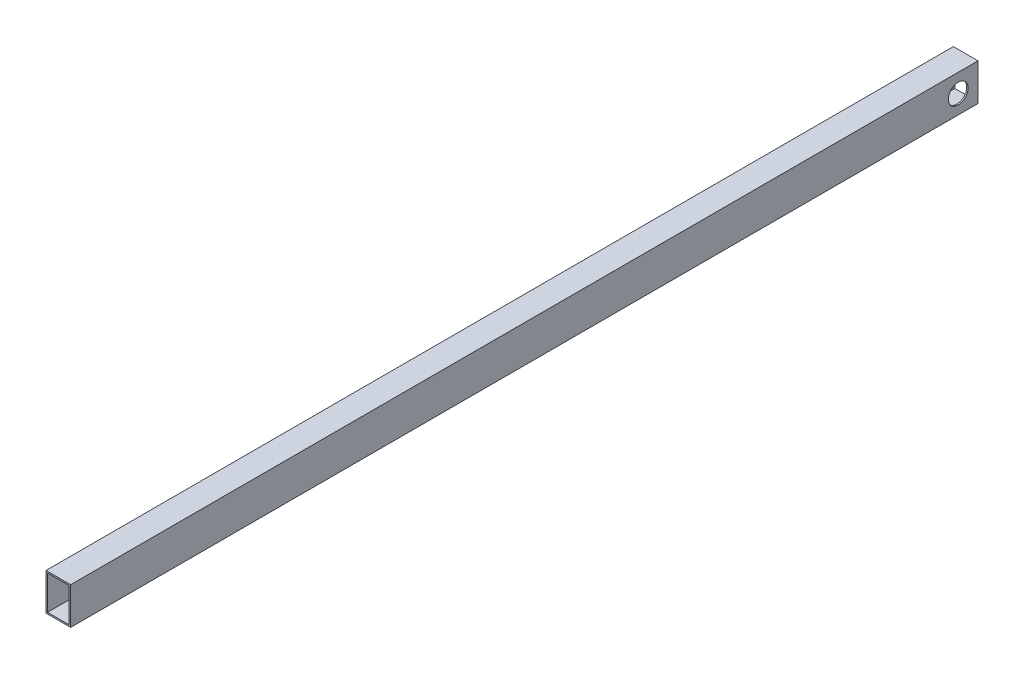
ISO-10303-21;
HEADER;
FILE_DESCRIPTION(('STEP AP214'),'2;1');
FILE_NAME('part.step','',(''),(''),'','','');
FILE_SCHEMA(('AUTOMOTIVE_DESIGN { 1 0 10303 214 1 1 1 1 }'));
ENDSEC;
DATA;
#1=APPLICATION_CONTEXT('core data for automotive mechanical design processes');
#2=APPLICATION_PROTOCOL_DEFINITION('international standard','automotive_design',2000,#1);
#3=PRODUCT_CONTEXT('',#1,'mechanical');
#4=PRODUCT('Part','Part','',(#3));
#5=PRODUCT_RELATED_PRODUCT_CATEGORY('part','',(#4));
#6=PRODUCT_DEFINITION_FORMATION('','',#4);
#7=PRODUCT_DEFINITION_CONTEXT('part definition',#1,'design');
#8=PRODUCT_DEFINITION('design','',#6,#7);
#9=PRODUCT_DEFINITION_SHAPE('','',#8);
#10=(LENGTH_UNIT() NAMED_UNIT(*) SI_UNIT(.MILLI.,.METRE.));
#11=(NAMED_UNIT(*) PLANE_ANGLE_UNIT() SI_UNIT($,.RADIAN.));
#12=(NAMED_UNIT(*) SI_UNIT($,.STERADIAN.) SOLID_ANGLE_UNIT());
#13=UNCERTAINTY_MEASURE_WITH_UNIT(LENGTH_MEASURE(1.E-05),#10,'distance_accuracy_value','');
#14=(GEOMETRIC_REPRESENTATION_CONTEXT(3) GLOBAL_UNCERTAINTY_ASSIGNED_CONTEXT((#13)) GLOBAL_UNIT_ASSIGNED_CONTEXT((#10,
#11,#12)) REPRESENTATION_CONTEXT('',''));
#15=CARTESIAN_POINT('',(0.,0.,0.));
#16=DIRECTION('',(0.,0.,1.));
#17=DIRECTION('',(1.,0.,0.));
#18=AXIS2_PLACEMENT_3D('',#15,#16,#17);
#19=CARTESIAN_POINT('',(-50.,-75.,-80.));
#20=DIRECTION('',(-1.,0.,0.));
#21=DIRECTION('',(0.,-1.,0.));
#22=AXIS2_PLACEMENT_3D('',#19,#20,#21);
#23=PLANE('',#22);
#24=CARTESIAN_POINT('',(-50.,0.,0.));
#25=DIRECTION('',(1.,0.,0.));
#26=DIRECTION('',(0.,0.,-1.));
#27=AXIS2_PLACEMENT_3D('',#24,#25,#26);
#28=CIRCLE('',#27,40.);
#29=CARTESIAN_POINT('',(-50.,0.,-40.));
#30=VERTEX_POINT('',#29);
#31=EDGE_CURVE('E195',#30,#30,#28,.T.);
#32=ORIENTED_EDGE('',*,*,#31,.T.);
#33=EDGE_LOOP('',(#32));
#34=FACE_BOUND('',#33,.T.);
#35=DIRECTION('',(0.,0.,1.));
#36=VECTOR('',#35,1.);
#37=CARTESIAN_POINT('',(-50.,-75.,-80.));
#38=LINE('',#37,#36);
#39=CARTESIAN_POINT('',(-50.,-75.,-80.));
#40=VERTEX_POINT('',#39);
#41=CARTESIAN_POINT('',(-50.,-75.,3600.));
#42=VERTEX_POINT('',#41);
#43=EDGE_CURVE('E161',#40,#42,#38,.T.);
#44=ORIENTED_EDGE('',*,*,#43,.T.);
#45=DIRECTION('',(0.,-1.,0.));
#46=VECTOR('',#45,1.);
#47=CARTESIAN_POINT('',(-50.,-75.,3600.));
#48=LINE('',#47,#46);
#49=CARTESIAN_POINT('',(-50.,74.9999999999999,3600.));
#50=VERTEX_POINT('',#49);
#51=EDGE_CURVE('E129',#50,#42,#48,.T.);
#52=ORIENTED_EDGE('',*,*,#51,.F.);
#53=DIRECTION('',(0.,0.,1.));
#54=VECTOR('',#53,1.);
#55=CARTESIAN_POINT('',(-50.,74.9999999999999,-80.));
#56=LINE('',#55,#54);
#57=CARTESIAN_POINT('',(-50.,74.9999999999999,-80.));
#58=VERTEX_POINT('',#57);
#59=EDGE_CURVE('E11',#58,#50,#56,.T.);
#60=ORIENTED_EDGE('',*,*,#59,.F.);
#61=DIRECTION('',(0.,-1.,0.));
#62=VECTOR('',#61,1.);
#63=CARTESIAN_POINT('',(-50.,-75.,-80.));
#64=LINE('',#63,#62);
#65=EDGE_CURVE('E148',#58,#40,#64,.T.);
#66=ORIENTED_EDGE('',*,*,#65,.T.);
#67=EDGE_LOOP('',(#44,#52,#60,#66));
#68=FACE_BOUND('',#67,.T.);
#69=ADVANCED_FACE('F32',(#34,#68),#23,.T.);
#70=CARTESIAN_POINT('',(-50.,74.9999999999999,-80.));
#71=DIRECTION('',(0.,1.,0.));
#72=DIRECTION('',(-1.,0.,0.));
#73=AXIS2_PLACEMENT_3D('',#70,#71,#72);
#74=PLANE('',#73);
#75=ORIENTED_EDGE('',*,*,#59,.T.);
#76=DIRECTION('',(-1.,0.,0.));
#77=VECTOR('',#76,1.);
#78=CARTESIAN_POINT('',(-50.,74.9999999999999,3600.));
#79=LINE('',#78,#77);
#80=CARTESIAN_POINT('',(50.,75.,3600.));
#81=VERTEX_POINT('',#80);
#82=EDGE_CURVE('E138',#81,#50,#79,.T.);
#83=ORIENTED_EDGE('',*,*,#82,.F.);
#84=DIRECTION('',(0.,0.,1.));
#85=VECTOR('',#84,1.);
#86=CARTESIAN_POINT('',(50.,75.,-80.));
#87=LINE('',#86,#85);
#88=CARTESIAN_POINT('',(50.,75.,-80.));
#89=VERTEX_POINT('',#88);
#90=EDGE_CURVE('E40',#89,#81,#87,.T.);
#91=ORIENTED_EDGE('',*,*,#90,.F.);
#92=DIRECTION('',(-1.,0.,0.));
#93=VECTOR('',#92,1.);
#94=CARTESIAN_POINT('',(-50.,74.9999999999999,-80.));
#95=LINE('',#94,#93);
#96=EDGE_CURVE('E159',#89,#58,#95,.T.);
#97=ORIENTED_EDGE('',*,*,#96,.T.);
#98=EDGE_LOOP('',(#75,#83,#91,#97));
#99=FACE_BOUND('',#98,.T.);
#100=ADVANCED_FACE('F173',(#99),#74,.T.);
#101=CARTESIAN_POINT('',(50.,-75.,-80.));
#102=DIRECTION('',(1.,0.,0.));
#103=DIRECTION('',(0.,1.,0.));
#104=AXIS2_PLACEMENT_3D('',#101,#102,#103);
#105=PLANE('',#104);
#106=CARTESIAN_POINT('',(50.,0.,0.));
#107=DIRECTION('',(1.,0.,0.));
#108=DIRECTION('',(0.,0.,-1.));
#109=AXIS2_PLACEMENT_3D('',#106,#107,#108);
#110=CIRCLE('',#109,40.);
#111=CARTESIAN_POINT('',(50.,0.,-40.));
#112=VERTEX_POINT('',#111);
#113=EDGE_CURVE('E197',#112,#112,#110,.T.);
#114=ORIENTED_EDGE('',*,*,#113,.F.);
#115=EDGE_LOOP('',(#114));
#116=FACE_BOUND('',#115,.T.);
#117=ORIENTED_EDGE('',*,*,#90,.T.);
#118=DIRECTION('',(0.,1.,0.));
#119=VECTOR('',#118,1.);
#120=CARTESIAN_POINT('',(50.,-75.,3600.));
#121=LINE('',#120,#119);
#122=CARTESIAN_POINT('',(50.,-75.,3600.));
#123=VERTEX_POINT('',#122);
#124=EDGE_CURVE('E135',#123,#81,#121,.T.);
#125=ORIENTED_EDGE('',*,*,#124,.F.);
#126=DIRECTION('',(0.,0.,1.));
#127=VECTOR('',#126,1.);
#128=CARTESIAN_POINT('',(50.,-75.,-80.));
#129=LINE('',#128,#127);
#130=CARTESIAN_POINT('',(50.,-75.,-80.));
#131=VERTEX_POINT('',#130);
#132=EDGE_CURVE('E164',#131,#123,#129,.T.);
#133=ORIENTED_EDGE('',*,*,#132,.F.);
#134=DIRECTION('',(0.,1.,0.));
#135=VECTOR('',#134,1.);
#136=CARTESIAN_POINT('',(50.,-75.,-80.));
#137=LINE('',#136,#135);
#138=EDGE_CURVE('E156',#131,#89,#137,.T.);
#139=ORIENTED_EDGE('',*,*,#138,.T.);
#140=EDGE_LOOP('',(#117,#125,#133,#139));
#141=FACE_BOUND('',#140,.T.);
#142=ADVANCED_FACE('F179',(#116,#141),#105,.T.);
#143=CARTESIAN_POINT('',(-50.,-75.,-80.));
#144=DIRECTION('',(0.,-1.,0.));
#145=DIRECTION('',(0.,0.,-1.));
#146=AXIS2_PLACEMENT_3D('',#143,#144,#145);
#147=PLANE('',#146);
#148=ORIENTED_EDGE('',*,*,#132,.T.);
#149=DIRECTION('',(1.,0.,0.));
#150=VECTOR('',#149,1.);
#151=CARTESIAN_POINT('',(-50.,-75.,3600.));
#152=LINE('',#151,#150);
#153=EDGE_CURVE('E132',#42,#123,#152,.T.);
#154=ORIENTED_EDGE('',*,*,#153,.F.);
#155=ORIENTED_EDGE('',*,*,#43,.F.);
#156=DIRECTION('',(1.,0.,0.));
#157=VECTOR('',#156,1.);
#158=CARTESIAN_POINT('',(-50.,-75.,-80.));
#159=LINE('',#158,#157);
#160=EDGE_CURVE('E153',#40,#131,#159,.T.);
#161=ORIENTED_EDGE('',*,*,#160,.T.);
#162=EDGE_LOOP('',(#148,#154,#155,#161));
#163=FACE_BOUND('',#162,.T.);
#164=ADVANCED_FACE('F168',(#163),#147,.T.);
#165=CARTESIAN_POINT('',(0.,0.,-80.));
#166=DIRECTION('',(0.,0.,-1.));
#167=DIRECTION('',(-1.,0.,0.));
#168=AXIS2_PLACEMENT_3D('',#165,#166,#167);
#169=PLANE('',#168);
#170=DIRECTION('',(0.,-1.,0.));
#171=VECTOR('',#170,1.);
#172=CARTESIAN_POINT('',(-44.,-69.,-80.));
#173=LINE('',#172,#171);
#174=CARTESIAN_POINT('',(-44.,69.,-80.));
#175=VERTEX_POINT('',#174);
#176=CARTESIAN_POINT('',(-44.,-69.,-80.));
#177=VERTEX_POINT('',#176);
#178=EDGE_CURVE('E141',#175,#177,#173,.T.);
#179=ORIENTED_EDGE('',*,*,#178,.T.);
#180=DIRECTION('',(1.,0.,0.));
#181=VECTOR('',#180,1.);
#182=CARTESIAN_POINT('',(-44.,-69.,-80.));
#183=LINE('',#182,#181);
#184=CARTESIAN_POINT('',(44.,-69.,-80.));
#185=VERTEX_POINT('',#184);
#186=EDGE_CURVE('E104',#177,#185,#183,.T.);
#187=ORIENTED_EDGE('',*,*,#186,.T.);
#188=DIRECTION('',(0.,1.,0.));
#189=VECTOR('',#188,1.);
#190=CARTESIAN_POINT('',(44.,-69.,-80.));
#191=LINE('',#190,#189);
#192=CARTESIAN_POINT('',(44.,69.,-80.));
#193=VERTEX_POINT('',#192);
#194=EDGE_CURVE('E48',#185,#193,#191,.T.);
#195=ORIENTED_EDGE('',*,*,#194,.T.);
#196=DIRECTION('',(-1.,0.,0.));
#197=VECTOR('',#196,1.);
#198=CARTESIAN_POINT('',(-44.,69.,-80.));
#199=LINE('',#198,#197);
#200=EDGE_CURVE('E109',#193,#175,#199,.T.);
#201=ORIENTED_EDGE('',*,*,#200,.T.);
#202=EDGE_LOOP('',(#179,#187,#195,#201));
#203=FACE_BOUND('',#202,.T.);
#204=ORIENTED_EDGE('',*,*,#65,.F.);
#205=ORIENTED_EDGE('',*,*,#96,.F.);
#206=ORIENTED_EDGE('',*,*,#138,.F.);
#207=ORIENTED_EDGE('',*,*,#160,.F.);
#208=EDGE_LOOP('',(#204,#205,#206,#207));
#209=FACE_BOUND('',#208,.T.);
#210=ADVANCED_FACE('F177',(#203,#209),#169,.T.);
#211=CARTESIAN_POINT('',(-44.,-69.,-80.));
#212=DIRECTION('',(-1.,0.,0.));
#213=DIRECTION('',(0.,0.,1.));
#214=AXIS2_PLACEMENT_3D('',#211,#212,#213);
#215=PLANE('',#214);
#216=CARTESIAN_POINT('',(-44.,0.,0.));
#217=DIRECTION('',(-1.,0.,0.));
#218=DIRECTION('',(0.,0.,1.));
#219=AXIS2_PLACEMENT_3D('',#216,#217,#218);
#220=CIRCLE('',#219,40.);
#221=CARTESIAN_POINT('',(-44.,0.,40.));
#222=VERTEX_POINT('',#221);
#223=EDGE_CURVE('E118',#222,#222,#220,.T.);
#224=ORIENTED_EDGE('',*,*,#223,.T.);
#225=EDGE_LOOP('',(#224));
#226=FACE_BOUND('',#225,.T.);
#227=DIRECTION('',(0.,0.,1.));
#228=VECTOR('',#227,1.);
#229=CARTESIAN_POINT('',(-44.,69.,-80.));
#230=LINE('',#229,#228);
#231=CARTESIAN_POINT('',(-44.,69.,3600.));
#232=VERTEX_POINT('',#231);
#233=EDGE_CURVE('E114',#175,#232,#230,.T.);
#234=ORIENTED_EDGE('',*,*,#233,.T.);
#235=DIRECTION('',(0.,-1.,0.));
#236=VECTOR('',#235,1.);
#237=CARTESIAN_POINT('',(-44.,-69.,3600.));
#238=LINE('',#237,#236);
#239=CARTESIAN_POINT('',(-44.,-69.,3600.));
#240=VERTEX_POINT('',#239);
#241=EDGE_CURVE('E112',#232,#240,#238,.T.);
#242=ORIENTED_EDGE('',*,*,#241,.T.);
#243=DIRECTION('',(0.,0.,1.));
#244=VECTOR('',#243,1.);
#245=CARTESIAN_POINT('',(-44.,-69.,-80.));
#246=LINE('',#245,#244);
#247=EDGE_CURVE('E97',#177,#240,#246,.T.);
#248=ORIENTED_EDGE('',*,*,#247,.F.);
#249=ORIENTED_EDGE('',*,*,#178,.F.);
#250=EDGE_LOOP('',(#234,#242,#248,#249));
#251=FACE_BOUND('',#250,.T.);
#252=ADVANCED_FACE('F113',(#226,#251),#215,.F.);
#253=CARTESIAN_POINT('',(-44.,69.,-80.));
#254=DIRECTION('',(0.,1.,0.));
#255=DIRECTION('',(0.,0.,1.));
#256=AXIS2_PLACEMENT_3D('',#253,#254,#255);
#257=PLANE('',#256);
#258=DIRECTION('',(0.,0.,1.));
#259=VECTOR('',#258,1.);
#260=CARTESIAN_POINT('',(44.,69.,-80.));
#261=LINE('',#260,#259);
#262=CARTESIAN_POINT('',(44.,69.,3600.));
#263=VERTEX_POINT('',#262);
#264=EDGE_CURVE('E149',#193,#263,#261,.T.);
#265=ORIENTED_EDGE('',*,*,#264,.T.);
#266=DIRECTION('',(-1.,0.,0.));
#267=VECTOR('',#266,1.);
#268=CARTESIAN_POINT('',(-44.,69.,3600.));
#269=LINE('',#268,#267);
#270=EDGE_CURVE('E124',#263,#232,#269,.T.);
#271=ORIENTED_EDGE('',*,*,#270,.T.);
#272=ORIENTED_EDGE('',*,*,#233,.F.);
#273=ORIENTED_EDGE('',*,*,#200,.F.);
#274=EDGE_LOOP('',(#265,#271,#272,#273));
#275=FACE_BOUND('',#274,.T.);
#276=ADVANCED_FACE('F217',(#275),#257,.F.);
#277=CARTESIAN_POINT('',(44.,-69.,-80.));
#278=DIRECTION('',(1.,0.,0.));
#279=DIRECTION('',(0.,0.,-1.));
#280=AXIS2_PLACEMENT_3D('',#277,#278,#279);
#281=PLANE('',#280);
#282=CARTESIAN_POINT('',(44.,0.,0.));
#283=DIRECTION('',(1.,0.,0.));
#284=DIRECTION('',(0.,0.,-1.));
#285=AXIS2_PLACEMENT_3D('',#282,#283,#284);
#286=CIRCLE('',#285,40.);
#287=CARTESIAN_POINT('',(44.,0.,-40.));
#288=VERTEX_POINT('',#287);
#289=EDGE_CURVE('E35',#288,#288,#286,.T.);
#290=ORIENTED_EDGE('',*,*,#289,.T.);
#291=EDGE_LOOP('',(#290));
#292=FACE_BOUND('',#291,.T.);
#293=DIRECTION('',(0.,0.,1.));
#294=VECTOR('',#293,1.);
#295=CARTESIAN_POINT('',(44.,-69.,-80.));
#296=LINE('',#295,#294);
#297=CARTESIAN_POINT('',(44.,-69.,3600.));
#298=VERTEX_POINT('',#297);
#299=EDGE_CURVE('E108',#185,#298,#296,.T.);
#300=ORIENTED_EDGE('',*,*,#299,.T.);
#301=DIRECTION('',(0.,1.,0.));
#302=VECTOR('',#301,1.);
#303=CARTESIAN_POINT('',(44.,-69.,3600.));
#304=LINE('',#303,#302);
#305=EDGE_CURVE('E122',#298,#263,#304,.T.);
#306=ORIENTED_EDGE('',*,*,#305,.T.);
#307=ORIENTED_EDGE('',*,*,#264,.F.);
#308=ORIENTED_EDGE('',*,*,#194,.F.);
#309=EDGE_LOOP('',(#300,#306,#307,#308));
#310=FACE_BOUND('',#309,.T.);
#311=ADVANCED_FACE('F220',(#292,#310),#281,.F.);
#312=CARTESIAN_POINT('',(-44.,-69.,-80.));
#313=DIRECTION('',(0.,-1.,0.));
#314=DIRECTION('',(0.,0.,-1.));
#315=AXIS2_PLACEMENT_3D('',#312,#313,#314);
#316=PLANE('',#315);
#317=ORIENTED_EDGE('',*,*,#247,.T.);
#318=DIRECTION('',(1.,0.,0.));
#319=VECTOR('',#318,1.);
#320=CARTESIAN_POINT('',(-44.,-69.,3600.));
#321=LINE('',#320,#319);
#322=EDGE_CURVE('E101',#240,#298,#321,.T.);
#323=ORIENTED_EDGE('',*,*,#322,.T.);
#324=ORIENTED_EDGE('',*,*,#299,.F.);
#325=ORIENTED_EDGE('',*,*,#186,.F.);
#326=EDGE_LOOP('',(#317,#323,#324,#325));
#327=FACE_BOUND('',#326,.T.);
#328=ADVANCED_FACE('F99',(#327),#316,.F.);
#329=CARTESIAN_POINT('',(0.,0.,3600.));
#330=DIRECTION('',(0.,0.,-1.));
#331=DIRECTION('',(-1.,0.,0.));
#332=AXIS2_PLACEMENT_3D('',#329,#330,#331);
#333=PLANE('',#332);
#334=ORIENTED_EDGE('',*,*,#51,.T.);
#335=ORIENTED_EDGE('',*,*,#153,.T.);
#336=ORIENTED_EDGE('',*,*,#124,.T.);
#337=ORIENTED_EDGE('',*,*,#82,.T.);
#338=EDGE_LOOP('',(#334,#335,#336,#337));
#339=FACE_BOUND('',#338,.T.);
#340=ORIENTED_EDGE('',*,*,#241,.F.);
#341=ORIENTED_EDGE('',*,*,#270,.F.);
#342=ORIENTED_EDGE('',*,*,#305,.F.);
#343=ORIENTED_EDGE('',*,*,#322,.F.);
#344=EDGE_LOOP('',(#340,#341,#342,#343));
#345=FACE_BOUND('',#344,.T.);
#346=ADVANCED_FACE('F120',(#339,#345),#333,.F.);
#347=CARTESIAN_POINT('',(-50.,0.,0.));
#348=DIRECTION('',(1.,0.,0.));
#349=DIRECTION('',(0.,0.,-1.));
#350=AXIS2_PLACEMENT_3D('',#347,#348,#349);
#351=CYLINDRICAL_SURFACE('',#350,40.);
#352=ORIENTED_EDGE('',*,*,#113,.T.);
#353=EDGE_LOOP('',(#352));
#354=FACE_BOUND('',#353,.T.);
#355=ORIENTED_EDGE('',*,*,#289,.F.);
#356=EDGE_LOOP('',(#355));
#357=FACE_BOUND('',#356,.T.);
#358=ADVANCED_FACE('F208',(#354,#357),#351,.F.);
#359=ORIENTED_EDGE('',*,*,#31,.F.);
#360=EDGE_LOOP('',(#359));
#361=FACE_BOUND('',#360,.T.);
#362=ORIENTED_EDGE('',*,*,#223,.F.);
#363=EDGE_LOOP('',(#362));
#364=FACE_BOUND('',#363,.T.);
#365=ADVANCED_FACE('F206',(#361,#364),#351,.F.);
#366=CLOSED_SHELL('',(#69,#100,#142,#164,#210,#252,#276,#311,#328,#346,#358,#365));
#367=MANIFOLD_SOLID_BREP('B2',#366);
#368=ADVANCED_BREP_SHAPE_REPRESENTATION('',(#18,#367),#14);
#369=SHAPE_DEFINITION_REPRESENTATION(#9,#368);
ENDSEC;
END-ISO-10303-21;
